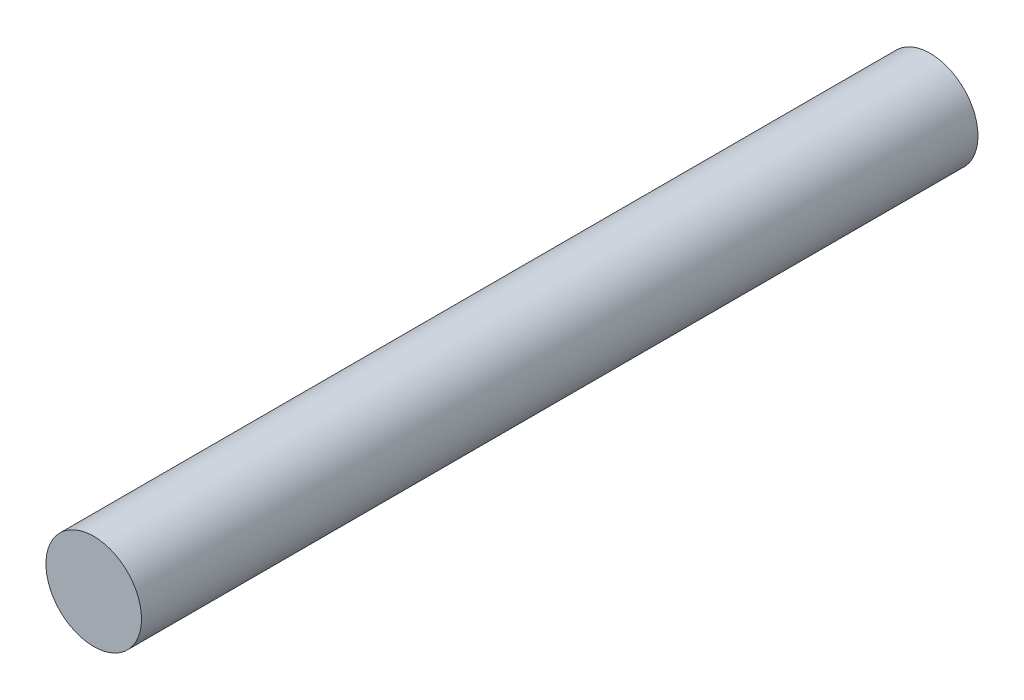
ISO-10303-21;
HEADER;
FILE_DESCRIPTION(('STEP AP214'),'2;1');
FILE_NAME('part.step','',(''),(''),'','','');
FILE_SCHEMA(('AUTOMOTIVE_DESIGN { 1 0 10303 214 1 1 1 1 }'));
ENDSEC;
DATA;
#1=APPLICATION_CONTEXT('core data for automotive mechanical design processes');
#2=APPLICATION_PROTOCOL_DEFINITION('international standard','automotive_design',2000,#1);
#3=PRODUCT_CONTEXT('',#1,'mechanical');
#4=PRODUCT('Part','Part','',(#3));
#5=PRODUCT_RELATED_PRODUCT_CATEGORY('part','',(#4));
#6=PRODUCT_DEFINITION_FORMATION('','',#4);
#7=PRODUCT_DEFINITION_CONTEXT('part definition',#1,'design');
#8=PRODUCT_DEFINITION('design','',#6,#7);
#9=PRODUCT_DEFINITION_SHAPE('','',#8);
#10=(LENGTH_UNIT() NAMED_UNIT(*) SI_UNIT(.MILLI.,.METRE.));
#11=(NAMED_UNIT(*) PLANE_ANGLE_UNIT() SI_UNIT($,.RADIAN.));
#12=(NAMED_UNIT(*) SI_UNIT($,.STERADIAN.) SOLID_ANGLE_UNIT());
#13=UNCERTAINTY_MEASURE_WITH_UNIT(LENGTH_MEASURE(1.E-05),#10,'distance_accuracy_value','');
#14=(GEOMETRIC_REPRESENTATION_CONTEXT(3) GLOBAL_UNCERTAINTY_ASSIGNED_CONTEXT((#13)) GLOBAL_UNIT_ASSIGNED_CONTEXT((#10,
#11,#12)) REPRESENTATION_CONTEXT('',''));
#15=CARTESIAN_POINT('',(0.,0.,0.));
#16=DIRECTION('',(0.,0.,1.));
#17=DIRECTION('',(1.,0.,0.));
#18=AXIS2_PLACEMENT_3D('',#15,#16,#17);
#19=CARTESIAN_POINT('',(280.,2.93284432462823E-12,70.));
#20=DIRECTION('',(0.,0.,-1.));
#21=DIRECTION('',(-1.,0.,0.));
#22=AXIS2_PLACEMENT_3D('',#19,#20,#21);
#23=CYLINDRICAL_SURFACE('',#22,3.99999999999999);
#24=CARTESIAN_POINT('',(280.,2.93284432462823E-12,70.));
#25=DIRECTION('',(0.,0.,1.));
#26=DIRECTION('',(1.,0.,0.));
#27=AXIS2_PLACEMENT_3D('',#24,#25,#26);
#28=CIRCLE('',#27,3.99999999999999);
#29=CARTESIAN_POINT('',(284.,2.93284432462823E-12,70.));
#30=VERTEX_POINT('',#29);
#31=EDGE_CURVE('E10',#30,#30,#28,.T.);
#32=ORIENTED_EDGE('',*,*,#31,.F.);
#33=EDGE_LOOP('',(#32));
#34=FACE_BOUND('',#33,.T.);
#35=CARTESIAN_POINT('',(280.,2.93284432462823E-12,0.));
#36=DIRECTION('',(0.,0.,1.));
#37=DIRECTION('',(1.,0.,0.));
#38=AXIS2_PLACEMENT_3D('',#35,#36,#37);
#39=CIRCLE('',#38,3.99999999999999);
#40=CARTESIAN_POINT('',(284.,2.93284432462823E-12,0.));
#41=VERTEX_POINT('',#40);
#42=EDGE_CURVE('E34',#41,#41,#39,.T.);
#43=ORIENTED_EDGE('',*,*,#42,.T.);
#44=EDGE_LOOP('',(#43));
#45=FACE_BOUND('',#44,.T.);
#46=ADVANCED_FACE('F31',(#34,#45),#23,.T.);
#47=CARTESIAN_POINT('',(280.,2.93284432462823E-12,70.));
#48=DIRECTION('',(0.,0.,1.));
#49=DIRECTION('',(1.,0.,0.));
#50=AXIS2_PLACEMENT_3D('',#47,#48,#49);
#51=PLANE('',#50);
#52=ORIENTED_EDGE('',*,*,#31,.T.);
#53=EDGE_LOOP('',(#52));
#54=FACE_BOUND('',#53,.T.);
#55=ADVANCED_FACE('F46',(#54),#51,.T.);
#56=CARTESIAN_POINT('',(280.,2.93284432462823E-12,0.));
#57=DIRECTION('',(0.,0.,1.));
#58=DIRECTION('',(1.,0.,0.));
#59=AXIS2_PLACEMENT_3D('',#56,#57,#58);
#60=PLANE('',#59);
#61=ORIENTED_EDGE('',*,*,#42,.F.);
#62=EDGE_LOOP('',(#61));
#63=FACE_BOUND('',#62,.T.);
#64=ADVANCED_FACE('F44',(#63),#60,.F.);
#65=CLOSED_SHELL('',(#46,#55,#64));
#66=MANIFOLD_SOLID_BREP('B2',#65);
#67=ADVANCED_BREP_SHAPE_REPRESENTATION('',(#18,#66),#14);
#68=SHAPE_DEFINITION_REPRESENTATION(#9,#67);
ENDSEC;
END-ISO-10303-21;
